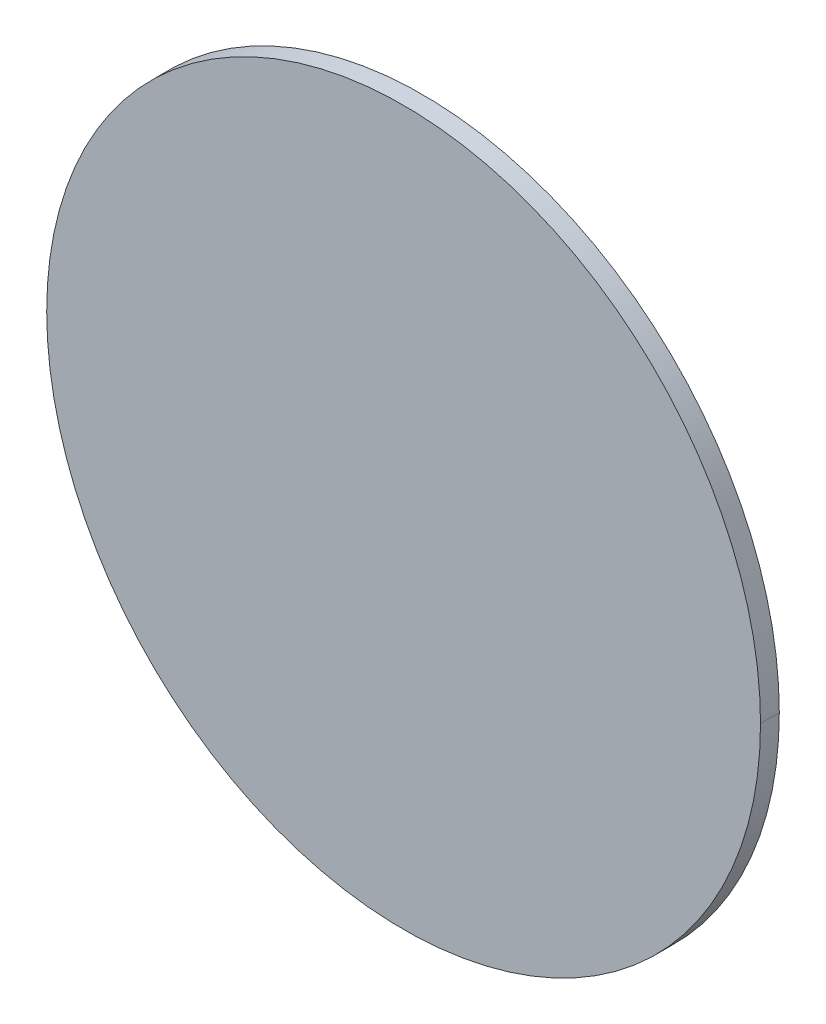
ISO-10303-21;
HEADER;
FILE_DESCRIPTION(('STEP AP214'),'2;1');
FILE_NAME('part.step','',(''),(''),'','','');
FILE_SCHEMA(('AUTOMOTIVE_DESIGN { 1 0 10303 214 1 1 1 1 }'));
ENDSEC;
DATA;
#1=APPLICATION_CONTEXT('core data for automotive mechanical design processes');
#2=APPLICATION_PROTOCOL_DEFINITION('international standard','automotive_design',2000,#1);
#3=PRODUCT_CONTEXT('',#1,'mechanical');
#4=PRODUCT('Part','Part','',(#3));
#5=PRODUCT_RELATED_PRODUCT_CATEGORY('part','',(#4));
#6=PRODUCT_DEFINITION_FORMATION('','',#4);
#7=PRODUCT_DEFINITION_CONTEXT('part definition',#1,'design');
#8=PRODUCT_DEFINITION('design','',#6,#7);
#9=PRODUCT_DEFINITION_SHAPE('','',#8);
#10=(LENGTH_UNIT() NAMED_UNIT(*) SI_UNIT(.MILLI.,.METRE.));
#11=(NAMED_UNIT(*) PLANE_ANGLE_UNIT() SI_UNIT($,.RADIAN.));
#12=(NAMED_UNIT(*) SI_UNIT($,.STERADIAN.) SOLID_ANGLE_UNIT());
#13=UNCERTAINTY_MEASURE_WITH_UNIT(LENGTH_MEASURE(1.E-05),#10,'distance_accuracy_value','');
#14=(GEOMETRIC_REPRESENTATION_CONTEXT(3) GLOBAL_UNCERTAINTY_ASSIGNED_CONTEXT((#13)) GLOBAL_UNIT_ASSIGNED_CONTEXT((#10,
#11,#12)) REPRESENTATION_CONTEXT('',''));
#15=CARTESIAN_POINT('',(0.,0.,0.));
#16=DIRECTION('',(0.,0.,1.));
#17=DIRECTION('',(1.,0.,0.));
#18=AXIS2_PLACEMENT_3D('',#15,#16,#17);
#19=CARTESIAN_POINT('',(0.,0.,0.));
#20=DIRECTION('',(0.,0.,1.));
#21=DIRECTION('',(1.,0.,0.));
#22=AXIS2_PLACEMENT_3D('',#19,#20,#21);
#23=PLANE('',#22);
#24=CARTESIAN_POINT('',(0.,0.,-3.72529007642E-10));
#25=DIRECTION('',(0.,0.,1.));
#26=DIRECTION('',(1.,0.,0.));
#27=AXIS2_PLACEMENT_3D('',#24,#25,#26);
#28=CIRCLE('',#27,7.6);
#29=CARTESIAN_POINT('',(-7.6,0.,-3.72529007642E-10));
#30=VERTEX_POINT('',#29);
#31=CARTESIAN_POINT('',(7.6,0.,-3.72529007642E-10));
#32=VERTEX_POINT('',#31);
#33=EDGE_CURVE('E11',#30,#32,#28,.T.);
#34=ORIENTED_EDGE('',*,*,#33,.F.);
#35=CARTESIAN_POINT('',(0.,0.,-3.72529007642E-10));
#36=DIRECTION('',(0.,0.,1.));
#37=DIRECTION('',(1.,0.,0.));
#38=AXIS2_PLACEMENT_3D('',#35,#36,#37);
#39=CIRCLE('',#38,7.6);
#40=EDGE_CURVE('E63',#32,#30,#39,.T.);
#41=ORIENTED_EDGE('',*,*,#40,.F.);
#42=EDGE_LOOP('',(#34,#41));
#43=FACE_BOUND('',#42,.T.);
#44=ADVANCED_FACE('F17',(#43),#23,.F.);
#45=CARTESIAN_POINT('',(0.,0.,0.4));
#46=DIRECTION('',(0.,0.,-1.));
#47=DIRECTION('',(-1.,0.,0.));
#48=AXIS2_PLACEMENT_3D('',#45,#46,#47);
#49=CYLINDRICAL_SURFACE('',#48,7.6);
#50=DIRECTION('',(0.,0.,-1.));
#51=VECTOR('',#50,1.);
#52=CARTESIAN_POINT('',(7.6,0.,0.400000000373));
#53=LINE('',#52,#51);
#54=CARTESIAN_POINT('',(7.6,0.,0.4));
#55=VERTEX_POINT('',#54);
#56=EDGE_CURVE('E20',#55,#32,#53,.T.);
#57=ORIENTED_EDGE('',*,*,#56,.F.);
#58=CARTESIAN_POINT('',(0.,0.,0.4));
#59=DIRECTION('',(0.,0.,1.));
#60=DIRECTION('',(1.,0.,0.));
#61=AXIS2_PLACEMENT_3D('',#58,#59,#60);
#62=CIRCLE('',#61,7.59999999963);
#63=CARTESIAN_POINT('',(-7.6,0.,0.4));
#64=VERTEX_POINT('',#63);
#65=EDGE_CURVE('E27',#64,#55,#62,.T.);
#66=ORIENTED_EDGE('',*,*,#65,.F.);
#67=DIRECTION('',(0.,0.,-1.));
#68=VECTOR('',#67,1.);
#69=CARTESIAN_POINT('',(-7.6,0.,0.400000000373));
#70=LINE('',#69,#68);
#71=EDGE_CURVE('E57',#64,#30,#70,.T.);
#72=ORIENTED_EDGE('',*,*,#71,.T.);
#73=ORIENTED_EDGE('',*,*,#33,.T.);
#74=EDGE_LOOP('',(#57,#66,#72,#73));
#75=FACE_BOUND('',#74,.T.);
#76=ADVANCED_FACE('F59',(#75),#49,.T.);
#77=CARTESIAN_POINT('',(0.,0.,0.4));
#78=DIRECTION('',(0.,0.,1.));
#79=DIRECTION('',(1.,0.,0.));
#80=AXIS2_PLACEMENT_3D('',#77,#78,#79);
#81=PLANE('',#80);
#82=ORIENTED_EDGE('',*,*,#65,.T.);
#83=CARTESIAN_POINT('',(0.,0.,0.4));
#84=DIRECTION('',(0.,0.,1.));
#85=DIRECTION('',(1.,0.,0.));
#86=AXIS2_PLACEMENT_3D('',#83,#84,#85);
#87=CIRCLE('',#86,7.6);
#88=EDGE_CURVE('E55',#55,#64,#87,.T.);
#89=ORIENTED_EDGE('',*,*,#88,.T.);
#90=EDGE_LOOP('',(#82,#89));
#91=FACE_BOUND('',#90,.T.);
#92=ADVANCED_FACE('F53',(#91),#81,.T.);
#93=CARTESIAN_POINT('',(0.,0.,0.4));
#94=DIRECTION('',(0.,0.,-1.));
#95=DIRECTION('',(-1.,0.,0.));
#96=AXIS2_PLACEMENT_3D('',#93,#94,#95);
#97=CYLINDRICAL_SURFACE('',#96,7.6);
#98=ORIENTED_EDGE('',*,*,#88,.F.);
#99=ORIENTED_EDGE('',*,*,#56,.T.);
#100=ORIENTED_EDGE('',*,*,#40,.T.);
#101=ORIENTED_EDGE('',*,*,#71,.F.);
#102=EDGE_LOOP('',(#98,#99,#100,#101));
#103=FACE_BOUND('',#102,.T.);
#104=ADVANCED_FACE('F64',(#103),#97,.T.);
#105=CLOSED_SHELL('',(#44,#76,#92,#104));
#106=MANIFOLD_SOLID_BREP('B1',#105);
#107=ADVANCED_BREP_SHAPE_REPRESENTATION('',(#18,#106),#14);
#108=SHAPE_DEFINITION_REPRESENTATION(#9,#107);
ENDSEC;
END-ISO-10303-21;
